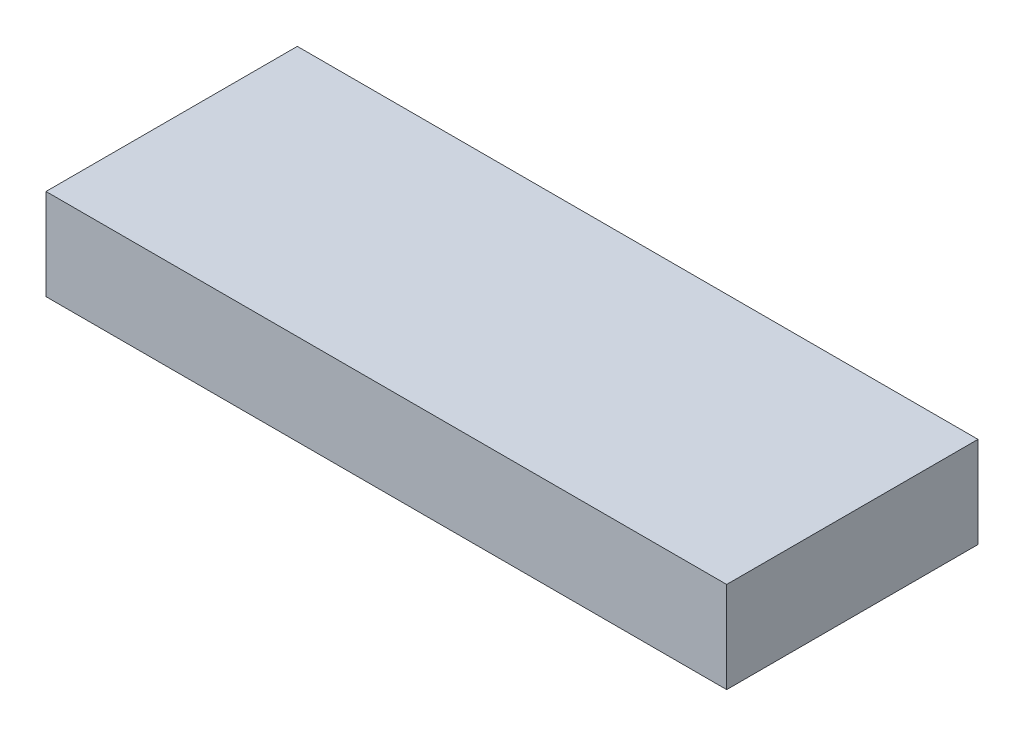
ISO-10303-21;
HEADER;
FILE_DESCRIPTION(('STEP AP214'),'2;1');
FILE_NAME('part.step','',(''),(''),'','','');
FILE_SCHEMA(('AUTOMOTIVE_DESIGN { 1 0 10303 214 1 1 1 1 }'));
ENDSEC;
DATA;
#1=APPLICATION_CONTEXT('core data for automotive mechanical design processes');
#2=APPLICATION_PROTOCOL_DEFINITION('international standard','automotive_design',2000,#1);
#3=PRODUCT_CONTEXT('',#1,'mechanical');
#4=PRODUCT('Part','Part','',(#3));
#5=PRODUCT_RELATED_PRODUCT_CATEGORY('part','',(#4));
#6=PRODUCT_DEFINITION_FORMATION('','',#4);
#7=PRODUCT_DEFINITION_CONTEXT('part definition',#1,'design');
#8=PRODUCT_DEFINITION('design','',#6,#7);
#9=PRODUCT_DEFINITION_SHAPE('','',#8);
#10=(LENGTH_UNIT() NAMED_UNIT(*) SI_UNIT(.MILLI.,.METRE.));
#11=(NAMED_UNIT(*) PLANE_ANGLE_UNIT() SI_UNIT($,.RADIAN.));
#12=(NAMED_UNIT(*) SI_UNIT($,.STERADIAN.) SOLID_ANGLE_UNIT());
#13=UNCERTAINTY_MEASURE_WITH_UNIT(LENGTH_MEASURE(1.E-05),#10,'distance_accuracy_value','');
#14=(GEOMETRIC_REPRESENTATION_CONTEXT(3) GLOBAL_UNCERTAINTY_ASSIGNED_CONTEXT((#13)) GLOBAL_UNIT_ASSIGNED_CONTEXT((#10,
#11,#12)) REPRESENTATION_CONTEXT('',''));
#15=CARTESIAN_POINT('',(0.,0.,0.));
#16=DIRECTION('',(0.,0.,1.));
#17=DIRECTION('',(1.,0.,0.));
#18=AXIS2_PLACEMENT_3D('',#15,#16,#17);
#19=CARTESIAN_POINT('',(16.25,4.35,-6.));
#20=DIRECTION('',(-1.,0.,0.));
#21=DIRECTION('',(0.,0.,1.));
#22=AXIS2_PLACEMENT_3D('',#19,#20,#21);
#23=PLANE('',#22);
#24=DIRECTION('',(0.,0.,-1.));
#25=VECTOR('',#24,1.);
#26=CARTESIAN_POINT('',(16.25,0.,-6.));
#27=LINE('',#26,#25);
#28=CARTESIAN_POINT('',(16.25,0.,6.));
#29=VERTEX_POINT('',#28);
#30=CARTESIAN_POINT('',(16.25,0.,-6.));
#31=VERTEX_POINT('',#30);
#32=EDGE_CURVE('E107',#29,#31,#27,.T.);
#33=ORIENTED_EDGE('',*,*,#32,.T.);
#34=DIRECTION('',(0.,-1.,0.));
#35=VECTOR('',#34,1.);
#36=CARTESIAN_POINT('',(16.25,4.35,-6.));
#37=LINE('',#36,#35);
#38=CARTESIAN_POINT('',(16.25,4.35,-6.));
#39=VERTEX_POINT('',#38);
#40=EDGE_CURVE('E11',#39,#31,#37,.T.);
#41=ORIENTED_EDGE('',*,*,#40,.F.);
#42=DIRECTION('',(0.,0.,-1.));
#43=VECTOR('',#42,1.);
#44=CARTESIAN_POINT('',(16.25,4.35,-6.));
#45=LINE('',#44,#43);
#46=CARTESIAN_POINT('',(16.25,4.35,6.));
#47=VERTEX_POINT('',#46);
#48=EDGE_CURVE('E91',#47,#39,#45,.T.);
#49=ORIENTED_EDGE('',*,*,#48,.F.);
#50=DIRECTION('',(0.,-1.,0.));
#51=VECTOR('',#50,1.);
#52=CARTESIAN_POINT('',(16.25,4.35,6.));
#53=LINE('',#52,#51);
#54=EDGE_CURVE('E103',#47,#29,#53,.T.);
#55=ORIENTED_EDGE('',*,*,#54,.T.);
#56=EDGE_LOOP('',(#33,#41,#49,#55));
#57=FACE_BOUND('',#56,.T.);
#58=ADVANCED_FACE('F39',(#57),#23,.F.);
#59=CARTESIAN_POINT('',(-16.25,4.35,-6.));
#60=DIRECTION('',(0.,0.,1.));
#61=DIRECTION('',(1.,0.,0.));
#62=AXIS2_PLACEMENT_3D('',#59,#60,#61);
#63=PLANE('',#62);
#64=DIRECTION('',(-1.,0.,0.));
#65=VECTOR('',#64,1.);
#66=CARTESIAN_POINT('',(-16.25,0.,-6.));
#67=LINE('',#66,#65);
#68=CARTESIAN_POINT('',(-16.25,0.,-6.));
#69=VERTEX_POINT('',#68);
#70=EDGE_CURVE('E96',#31,#69,#67,.T.);
#71=ORIENTED_EDGE('',*,*,#70,.T.);
#72=DIRECTION('',(0.,-1.,0.));
#73=VECTOR('',#72,1.);
#74=CARTESIAN_POINT('',(-16.25,4.35,-6.));
#75=LINE('',#74,#73);
#76=CARTESIAN_POINT('',(-16.25,4.35,-6.));
#77=VERTEX_POINT('',#76);
#78=EDGE_CURVE('E48',#77,#69,#75,.T.);
#79=ORIENTED_EDGE('',*,*,#78,.F.);
#80=DIRECTION('',(-1.,0.,0.));
#81=VECTOR('',#80,1.);
#82=CARTESIAN_POINT('',(-16.25,4.35,-6.));
#83=LINE('',#82,#81);
#84=EDGE_CURVE('E86',#39,#77,#83,.T.);
#85=ORIENTED_EDGE('',*,*,#84,.F.);
#86=ORIENTED_EDGE('',*,*,#40,.T.);
#87=EDGE_LOOP('',(#71,#79,#85,#86));
#88=FACE_BOUND('',#87,.T.);
#89=ADVANCED_FACE('F95',(#88),#63,.F.);
#90=CARTESIAN_POINT('',(-16.25,4.35,-6.));
#91=DIRECTION('',(1.,0.,0.));
#92=DIRECTION('',(0.,0.,-1.));
#93=AXIS2_PLACEMENT_3D('',#90,#91,#92);
#94=PLANE('',#93);
#95=DIRECTION('',(0.,0.,1.));
#96=VECTOR('',#95,1.);
#97=CARTESIAN_POINT('',(-16.25,0.,-6.));
#98=LINE('',#97,#96);
#99=CARTESIAN_POINT('',(-16.25,0.,6.));
#100=VERTEX_POINT('',#99);
#101=EDGE_CURVE('E73',#69,#100,#98,.T.);
#102=ORIENTED_EDGE('',*,*,#101,.T.);
#103=DIRECTION('',(0.,-1.,0.));
#104=VECTOR('',#103,1.);
#105=CARTESIAN_POINT('',(-16.25,4.35,6.));
#106=LINE('',#105,#104);
#107=CARTESIAN_POINT('',(-16.25,4.35,6.));
#108=VERTEX_POINT('',#107);
#109=EDGE_CURVE('E98',#108,#100,#106,.T.);
#110=ORIENTED_EDGE('',*,*,#109,.F.);
#111=DIRECTION('',(0.,0.,1.));
#112=VECTOR('',#111,1.);
#113=CARTESIAN_POINT('',(-16.25,4.35,-6.));
#114=LINE('',#113,#112);
#115=EDGE_CURVE('E89',#77,#108,#114,.T.);
#116=ORIENTED_EDGE('',*,*,#115,.F.);
#117=ORIENTED_EDGE('',*,*,#78,.T.);
#118=EDGE_LOOP('',(#102,#110,#116,#117));
#119=FACE_BOUND('',#118,.T.);
#120=ADVANCED_FACE('F99',(#119),#94,.F.);
#121=CARTESIAN_POINT('',(-16.25,4.35,6.));
#122=DIRECTION('',(0.,0.,-1.));
#123=DIRECTION('',(-1.,0.,0.));
#124=AXIS2_PLACEMENT_3D('',#121,#122,#123);
#125=PLANE('',#124);
#126=DIRECTION('',(1.,0.,0.));
#127=VECTOR('',#126,1.);
#128=CARTESIAN_POINT('',(-16.25,0.,6.));
#129=LINE('',#128,#127);
#130=EDGE_CURVE('E79',#100,#29,#129,.T.);
#131=ORIENTED_EDGE('',*,*,#130,.T.);
#132=ORIENTED_EDGE('',*,*,#54,.F.);
#133=DIRECTION('',(1.,0.,0.));
#134=VECTOR('',#133,1.);
#135=CARTESIAN_POINT('',(-16.25,4.35,6.));
#136=LINE('',#135,#134);
#137=EDGE_CURVE('E56',#108,#47,#136,.T.);
#138=ORIENTED_EDGE('',*,*,#137,.F.);
#139=ORIENTED_EDGE('',*,*,#109,.T.);
#140=EDGE_LOOP('',(#131,#132,#138,#139));
#141=FACE_BOUND('',#140,.T.);
#142=ADVANCED_FACE('F120',(#141),#125,.F.);
#143=CARTESIAN_POINT('',(0.,4.35,0.));
#144=DIRECTION('',(0.,1.,0.));
#145=DIRECTION('',(0.,0.,1.));
#146=AXIS2_PLACEMENT_3D('',#143,#144,#145);
#147=PLANE('',#146);
#148=ORIENTED_EDGE('',*,*,#48,.T.);
#149=ORIENTED_EDGE('',*,*,#84,.T.);
#150=ORIENTED_EDGE('',*,*,#115,.T.);
#151=ORIENTED_EDGE('',*,*,#137,.T.);
#152=EDGE_LOOP('',(#148,#149,#150,#151));
#153=FACE_BOUND('',#152,.T.);
#154=ADVANCED_FACE('F87',(#153),#147,.T.);
#155=CARTESIAN_POINT('',(0.,0.,0.));
#156=DIRECTION('',(0.,1.,0.));
#157=DIRECTION('',(0.,0.,1.));
#158=AXIS2_PLACEMENT_3D('',#155,#156,#157);
#159=PLANE('',#158);
#160=ORIENTED_EDGE('',*,*,#32,.F.);
#161=ORIENTED_EDGE('',*,*,#130,.F.);
#162=ORIENTED_EDGE('',*,*,#101,.F.);
#163=ORIENTED_EDGE('',*,*,#70,.F.);
#164=EDGE_LOOP('',(#160,#161,#162,#163));
#165=FACE_BOUND('',#164,.T.);
#166=ADVANCED_FACE('F123',(#165),#159,.F.);
#167=CLOSED_SHELL('',(#58,#89,#120,#142,#154,#166));
#168=MANIFOLD_SOLID_BREP('B2',#167);
#169=ADVANCED_BREP_SHAPE_REPRESENTATION('',(#18,#168),#14);
#170=SHAPE_DEFINITION_REPRESENTATION(#9,#169);
ENDSEC;
END-ISO-10303-21;
